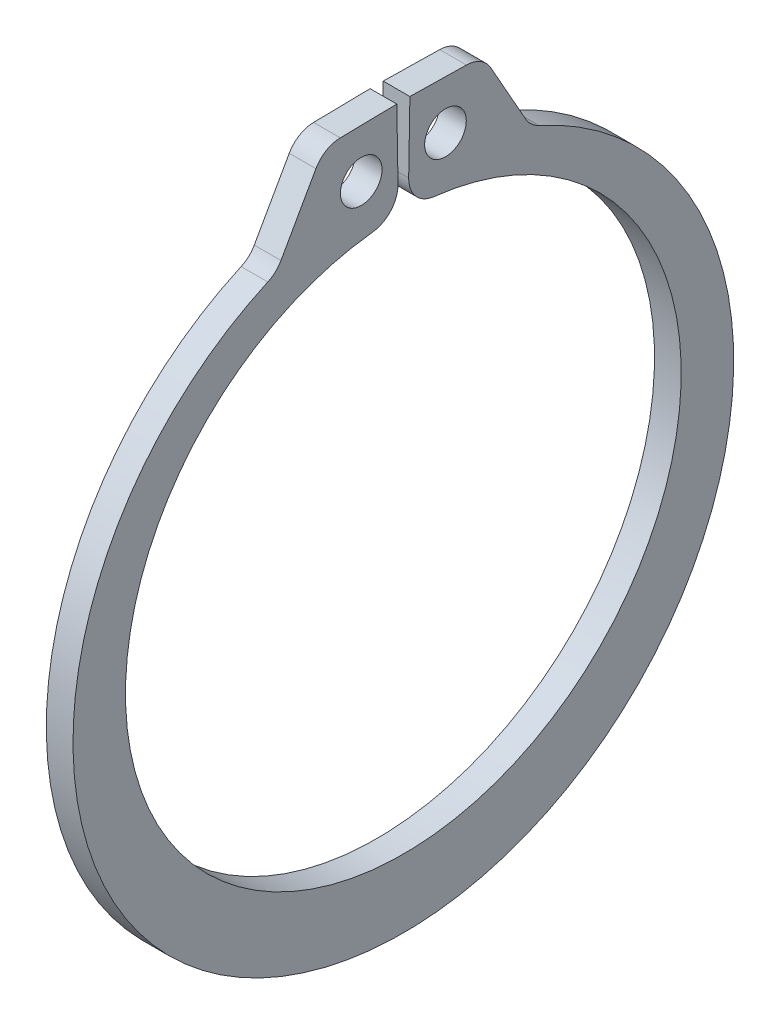
ISO-10303-21;
HEADER;
FILE_DESCRIPTION(('STEP AP214'),'2;1');
FILE_NAME('part.step','',(''),(''),'','','');
FILE_SCHEMA(('AUTOMOTIVE_DESIGN { 1 0 10303 214 1 1 1 1 }'));
ENDSEC;
DATA;
#1=APPLICATION_CONTEXT('core data for automotive mechanical design processes');
#2=APPLICATION_PROTOCOL_DEFINITION('international standard','automotive_design',2000,#1);
#3=PRODUCT_CONTEXT('',#1,'mechanical');
#4=PRODUCT('Part','Part','',(#3));
#5=PRODUCT_RELATED_PRODUCT_CATEGORY('part','',(#4));
#6=PRODUCT_DEFINITION_FORMATION('','',#4);
#7=PRODUCT_DEFINITION_CONTEXT('part definition',#1,'design');
#8=PRODUCT_DEFINITION('design','',#6,#7);
#9=PRODUCT_DEFINITION_SHAPE('','',#8);
#10=(LENGTH_UNIT() NAMED_UNIT(*) SI_UNIT(.MILLI.,.METRE.));
#11=(NAMED_UNIT(*) PLANE_ANGLE_UNIT() SI_UNIT($,.RADIAN.));
#12=(NAMED_UNIT(*) SI_UNIT($,.STERADIAN.) SOLID_ANGLE_UNIT());
#13=UNCERTAINTY_MEASURE_WITH_UNIT(LENGTH_MEASURE(1.E-05),#10,'distance_accuracy_value','');
#14=(GEOMETRIC_REPRESENTATION_CONTEXT(3) GLOBAL_UNCERTAINTY_ASSIGNED_CONTEXT((#13)) GLOBAL_UNIT_ASSIGNED_CONTEXT((#10,
#11,#12)) REPRESENTATION_CONTEXT('',''));
#15=CARTESIAN_POINT('',(0.,0.,0.));
#16=DIRECTION('',(0.,0.,1.));
#17=DIRECTION('',(1.,0.,0.));
#18=AXIS2_PLACEMENT_3D('',#15,#16,#17);
#19=CARTESIAN_POINT('',(0.635,-0.754341080067233,0.));
#20=DIRECTION('',(1.,0.,0.));
#21=DIRECTION('',(0.,0.,-1.));
#22=AXIS2_PLACEMENT_3D('',#19,#20,#21);
#23=PLANE('',#22);
#24=CARTESIAN_POINT('',(0.635,15.4994797667592,2.00435849396289));
#25=DIRECTION('',(1.,0.,0.));
#26=DIRECTION('',(0.,0.,-1.));
#27=AXIS2_PLACEMENT_3D('',#24,#25,#26);
#28=CIRCLE('',#27,0.990600000000001);
#29=CARTESIAN_POINT('',(0.635,15.4994797667592,1.01375849396289));
#30=VERTEX_POINT('',#29);
#31=EDGE_CURVE('E196',#30,#30,#28,.T.);
#32=ORIENTED_EDGE('',*,*,#31,.F.);
#33=EDGE_LOOP('',(#32));
#34=FACE_BOUND('',#33,.T.);
#35=DIRECTION('',(0.,0.87115587965409,0.491006551223208));
#36=VECTOR('',#35,1.);
#37=CARTESIAN_POINT('',(0.635,17.7802731101644,-3.77798395814039));
#38=LINE('',#37,#36);
#39=CARTESIAN_POINT('',(0.635,14.1508937957615,-5.82359836753103));
#40=VERTEX_POINT('',#39);
#41=CARTESIAN_POINT('',(0.635,17.1023893458657,-4.16005722081599));
#42=VERTEX_POINT('',#41);
#43=EDGE_CURVE('E204',#40,#42,#38,.T.);
#44=ORIENTED_EDGE('',*,*,#43,.T.);
#45=CARTESIAN_POINT('',(0.635,16.4351605434085,-2.97624349595404));
#46=DIRECTION('',(1.,0.,0.));
#47=DIRECTION('',(0.,0.,-1.));
#48=AXIS2_PLACEMENT_3D('',#45,#46,#47);
#49=CIRCLE('',#48,1.3589);
#50=CARTESIAN_POINT('',(0.635,17.7938535763566,-2.99995957106167));
#51=VERTEX_POINT('',#50);
#52=EDGE_CURVE('E263',#42,#51,#49,.T.);
#53=ORIENTED_EDGE('',*,*,#52,.T.);
#54=DIRECTION('',(0.,0.0174524064372832,0.999847695156391));
#55=VECTOR('',#54,1.);
#56=CARTESIAN_POINT('',(0.635,17.8407823485231,-0.311412014263668));
#57=LINE('',#56,#55);
#58=CARTESIAN_POINT('',(0.635,17.8407823485231,-0.311412014263668));
#59=VERTEX_POINT('',#58);
#60=EDGE_CURVE('E208',#51,#59,#57,.T.);
#61=ORIENTED_EDGE('',*,*,#60,.T.);
#62=DIRECTION('',(0.,-0.999847695156391,0.0174524064372838));
#63=VECTOR('',#62,1.);
#64=CARTESIAN_POINT('',(0.635,13.2186864233541,-0.230733029785392));
#65=LINE('',#64,#63);
#66=CARTESIAN_POINT('',(0.635,14.5139224558779,-0.253341458830463));
#67=VERTEX_POINT('',#66);
#68=EDGE_CURVE('E166',#59,#67,#65,.T.);
#69=ORIENTED_EDGE('',*,*,#68,.T.);
#70=CARTESIAN_POINT('',(0.635,14.4902063807703,-1.61203449177848));
#71=DIRECTION('',(1.,0.,0.));
#72=DIRECTION('',(0.,0.,-1.));
#73=AXIS2_PLACEMENT_3D('',#70,#71,#72);
#74=CIRCLE('',#73,1.3589);
#75=CARTESIAN_POINT('',(0.635,13.1396383644442,-1.46178389019286));
#76=VERTEX_POINT('',#75);
#77=EDGE_CURVE('E260',#67,#76,#74,.T.);
#78=ORIENTED_EDGE('',*,*,#77,.T.);
#79=CARTESIAN_POINT('',(0.635,0.,0.));
#80=DIRECTION('',(-1.,0.,0.));
#81=DIRECTION('',(0.,0.,-1.));
#82=AXIS2_PLACEMENT_3D('',#79,#80,#81);
#83=CIRCLE('',#82,13.2207);
#84=CARTESIAN_POINT('',(0.635,13.1396383644442,1.46178389019286));
#85=VERTEX_POINT('',#84);
#86=EDGE_CURVE('E213',#76,#85,#83,.T.);
#87=ORIENTED_EDGE('',*,*,#86,.T.);
#88=CARTESIAN_POINT('',(0.635,14.4902063807703,1.61203449177848));
#89=DIRECTION('',(1.,0.,0.));
#90=DIRECTION('',(0.,0.,-1.));
#91=AXIS2_PLACEMENT_3D('',#88,#89,#90);
#92=CIRCLE('',#91,1.3589);
#93=CARTESIAN_POINT('',(0.635,14.5139224558779,0.253341458830464));
#94=VERTEX_POINT('',#93);
#95=EDGE_CURVE('E257',#85,#94,#92,.T.);
#96=ORIENTED_EDGE('',*,*,#95,.T.);
#97=DIRECTION('',(0.,0.999847695156391,0.0174524064372836));
#98=VECTOR('',#97,1.);
#99=CARTESIAN_POINT('',(0.635,13.2186864233541,0.230733029785394));
#100=LINE('',#99,#98);
#101=CARTESIAN_POINT('',(0.635,17.8407823485231,0.311412014263668));
#102=VERTEX_POINT('',#101);
#103=EDGE_CURVE('E217',#94,#102,#100,.T.);
#104=ORIENTED_EDGE('',*,*,#103,.T.);
#105=DIRECTION('',(0.,-0.0174524064372832,0.999847695156391));
#106=VECTOR('',#105,1.);
#107=CARTESIAN_POINT('',(0.635,17.8407823485231,0.311412014263668));
#108=LINE('',#107,#106);
#109=CARTESIAN_POINT('',(0.635,17.7938535763566,2.99995957106167));
#110=VERTEX_POINT('',#109);
#111=EDGE_CURVE('E220',#102,#110,#108,.T.);
#112=ORIENTED_EDGE('',*,*,#111,.T.);
#113=CARTESIAN_POINT('',(0.635,16.4351605434085,2.97624349595404));
#114=DIRECTION('',(1.,0.,0.));
#115=DIRECTION('',(0.,0.,-1.));
#116=AXIS2_PLACEMENT_3D('',#113,#114,#115);
#117=CIRCLE('',#116,1.3589);
#118=CARTESIAN_POINT('',(0.635,17.1023893458657,4.16005722081599));
#119=VERTEX_POINT('',#118);
#120=EDGE_CURVE('E66',#110,#119,#117,.T.);
#121=ORIENTED_EDGE('',*,*,#120,.T.);
#122=DIRECTION('',(0.,-0.87115587965409,0.491006551223208));
#123=VECTOR('',#122,1.);
#124=CARTESIAN_POINT('',(0.635,17.7802731101644,3.77798395814039));
#125=LINE('',#124,#123);
#126=CARTESIAN_POINT('',(0.635,14.1508937957615,5.82359836753103));
#127=VERTEX_POINT('',#126);
#128=EDGE_CURVE('E223',#119,#127,#125,.T.);
#129=ORIENTED_EDGE('',*,*,#128,.T.);
#130=CARTESIAN_POINT('',(0.635,14.8181225982187,7.00741209239297));
#131=DIRECTION('',(1.,0.,0.));
#132=DIRECTION('',(0.,0.,-1.));
#133=AXIS2_PLACEMENT_3D('',#130,#131,#132);
#134=CIRCLE('',#133,1.3589);
#135=CARTESIAN_POINT('',(0.635,13.5789066113655,6.4497805402661));
#136=VERTEX_POINT('',#135);
#137=EDGE_CURVE('E11',#127,#136,#134,.F.);
#138=ORIENTED_EDGE('',*,*,#137,.T.);
#139=CARTESIAN_POINT('',(0.635,-0.754341080067233,0.));
#140=DIRECTION('',(1.,0.,0.));
#141=DIRECTION('',(0.,0.,-1.));
#142=AXIS2_PLACEMENT_3D('',#139,#140,#141);
#143=CIRCLE('',#142,15.7175589199328);
#144=CARTESIAN_POINT('',(0.635,13.5789066113655,-6.4497805402661));
#145=VERTEX_POINT('',#144);
#146=EDGE_CURVE('E200',#136,#145,#143,.T.);
#147=ORIENTED_EDGE('',*,*,#146,.T.);
#148=CARTESIAN_POINT('',(0.635,14.8181225982187,-7.00741209239297));
#149=DIRECTION('',(1.,0.,0.));
#150=DIRECTION('',(0.,0.,-1.));
#151=AXIS2_PLACEMENT_3D('',#148,#149,#150);
#152=CIRCLE('',#151,1.3589);
#153=EDGE_CURVE('E292',#145,#40,#152,.F.);
#154=ORIENTED_EDGE('',*,*,#153,.T.);
#155=EDGE_LOOP('',(#44,#53,#61,#69,#78,#87,#96,#104,#112,#121,#129,#138,#147,#154));
#156=FACE_BOUND('',#155,.T.);
#157=CARTESIAN_POINT('',(0.635,15.4994797667592,-2.00435849396289));
#158=DIRECTION('',(1.,0.,0.));
#159=DIRECTION('',(0.,0.,-1.));
#160=AXIS2_PLACEMENT_3D('',#157,#158,#159);
#161=CIRCLE('',#160,0.990600000000001);
#162=CARTESIAN_POINT('',(0.635,15.4994797667592,-2.99495849396289));
#163=VERTEX_POINT('',#162);
#164=EDGE_CURVE('E192',#163,#163,#161,.T.);
#165=ORIENTED_EDGE('',*,*,#164,.F.);
#166=EDGE_LOOP('',(#165));
#167=FACE_BOUND('',#166,.T.);
#168=ADVANCED_FACE('F43',(#34,#156,#167),#23,.T.);
#169=CARTESIAN_POINT('',(0.635,-0.754341080067233,0.));
#170=DIRECTION('',(-1.,0.,0.));
#171=DIRECTION('',(0.,0.,1.));
#172=AXIS2_PLACEMENT_3D('',#169,#170,#171);
#173=CYLINDRICAL_SURFACE('',#172,15.7175589199328);
#174=CARTESIAN_POINT('',(-0.635,-0.754341080067233,0.));
#175=DIRECTION('',(1.,0.,0.));
#176=DIRECTION('',(0.,0.,-1.));
#177=AXIS2_PLACEMENT_3D('',#174,#175,#176);
#178=CIRCLE('',#177,15.7175589199328);
#179=CARTESIAN_POINT('',(-0.635,13.5789066113655,6.4497805402661));
#180=VERTEX_POINT('',#179);
#181=CARTESIAN_POINT('',(-0.635,13.5789066113655,-6.4497805402661));
#182=VERTEX_POINT('',#181);
#183=EDGE_CURVE('E298',#180,#182,#178,.T.);
#184=ORIENTED_EDGE('',*,*,#183,.T.);
#185=DIRECTION('',(-1.,0.,0.));
#186=VECTOR('',#185,1.);
#187=CARTESIAN_POINT('',(0.635,13.5789066113655,-6.4497805402661));
#188=LINE('',#187,#186);
#189=EDGE_CURVE('E239',#182,#145,#188,.F.);
#190=ORIENTED_EDGE('',*,*,#189,.T.);
#191=ORIENTED_EDGE('',*,*,#146,.F.);
#192=DIRECTION('',(-1.,0.,0.));
#193=VECTOR('',#192,1.);
#194=CARTESIAN_POINT('',(0.635,13.5789066113655,6.44978054026611));
#195=LINE('',#194,#193);
#196=EDGE_CURVE('E235',#136,#180,#195,.T.);
#197=ORIENTED_EDGE('',*,*,#196,.T.);
#198=EDGE_LOOP('',(#184,#190,#191,#197));
#199=FACE_BOUND('',#198,.T.);
#200=ADVANCED_FACE('F308',(#199),#173,.T.);
#201=CARTESIAN_POINT('',(0.635,17.7802731101644,-3.77798395814039));
#202=DIRECTION('',(0.,-0.491006551223208,0.87115587965409));
#203=DIRECTION('',(0.,-0.87115587965409,-0.491006551223208));
#204=AXIS2_PLACEMENT_3D('',#201,#202,#203);
#205=PLANE('',#204);
#206=ORIENTED_EDGE('',*,*,#43,.F.);
#207=DIRECTION('',(1.,0.,0.));
#208=VECTOR('',#207,1.);
#209=CARTESIAN_POINT('',(-0.635,14.1508937957615,-5.82359836753103));
#210=LINE('',#209,#208);
#211=CARTESIAN_POINT('',(-0.635,14.1508937957615,-5.82359836753103));
#212=VERTEX_POINT('',#211);
#213=EDGE_CURVE('E231',#40,#212,#210,.F.);
#214=ORIENTED_EDGE('',*,*,#213,.T.);
#215=DIRECTION('',(0.,0.87115587965409,0.491006551223208));
#216=VECTOR('',#215,1.);
#217=CARTESIAN_POINT('',(-0.635,17.7802731101644,-3.77798395814039));
#218=LINE('',#217,#216);
#219=CARTESIAN_POINT('',(-0.635,17.1023893458657,-4.16005722081599));
#220=VERTEX_POINT('',#219);
#221=EDGE_CURVE('E159',#212,#220,#218,.T.);
#222=ORIENTED_EDGE('',*,*,#221,.T.);
#223=DIRECTION('',(-1.,0.,0.));
#224=VECTOR('',#223,1.);
#225=CARTESIAN_POINT('',(0.635,17.1023893458657,-4.16005722081599));
#226=LINE('',#225,#224);
#227=EDGE_CURVE('E168',#220,#42,#226,.F.);
#228=ORIENTED_EDGE('',*,*,#227,.T.);
#229=EDGE_LOOP('',(#206,#214,#222,#228));
#230=FACE_BOUND('',#229,.T.);
#231=ADVANCED_FACE('F316',(#230),#205,.F.);
#232=CARTESIAN_POINT('',(0.635,17.8407823485231,-0.311412014263668));
#233=DIRECTION('',(0.,-0.999847695156391,0.0174524064372832));
#234=DIRECTION('',(0.,-0.0174524064372832,-0.999847695156391));
#235=AXIS2_PLACEMENT_3D('',#232,#233,#234);
#236=PLANE('',#235);
#237=ORIENTED_EDGE('',*,*,#60,.F.);
#238=DIRECTION('',(-1.,0.,0.));
#239=VECTOR('',#238,1.);
#240=CARTESIAN_POINT('',(0.635,17.7938535763566,-2.99995957106167));
#241=LINE('',#240,#239);
#242=CARTESIAN_POINT('',(-0.635,17.7938535763566,-2.99995957106167));
#243=VERTEX_POINT('',#242);
#244=EDGE_CURVE('E154',#51,#243,#241,.T.);
#245=ORIENTED_EDGE('',*,*,#244,.T.);
#246=DIRECTION('',(0.,0.0174524064372832,0.999847695156391));
#247=VECTOR('',#246,1.);
#248=CARTESIAN_POINT('',(-0.635,17.8407823485231,-0.311412014263668));
#249=LINE('',#248,#247);
#250=CARTESIAN_POINT('',(-0.635,17.8407823485231,-0.311412014263668));
#251=VERTEX_POINT('',#250);
#252=EDGE_CURVE('E147',#243,#251,#249,.T.);
#253=ORIENTED_EDGE('',*,*,#252,.T.);
#254=DIRECTION('',(-1.,0.,0.));
#255=VECTOR('',#254,1.);
#256=CARTESIAN_POINT('',(0.635,17.8407823485231,-0.311412014263668));
#257=LINE('',#256,#255);
#258=EDGE_CURVE('E151',#59,#251,#257,.T.);
#259=ORIENTED_EDGE('',*,*,#258,.F.);
#260=EDGE_LOOP('',(#237,#245,#253,#259));
#261=FACE_BOUND('',#260,.T.);
#262=ADVANCED_FACE('F150',(#261),#236,.F.);
#263=CARTESIAN_POINT('',(0.635,13.2186864233541,-0.230733029785392));
#264=DIRECTION('',(0.,-0.0174524064372838,-0.999847695156391));
#265=DIRECTION('',(0.,0.999847695156391,-0.0174524064372838));
#266=AXIS2_PLACEMENT_3D('',#263,#264,#265);
#267=PLANE('',#266);
#268=DIRECTION('',(0.,-0.999847695156391,0.0174524064372838));
#269=VECTOR('',#268,1.);
#270=CARTESIAN_POINT('',(-0.635,13.2186864233541,-0.230733029785392));
#271=LINE('',#270,#269);
#272=CARTESIAN_POINT('',(-0.635,14.5139224558779,-0.253341458830463));
#273=VERTEX_POINT('',#272);
#274=EDGE_CURVE('E158',#251,#273,#271,.T.);
#275=ORIENTED_EDGE('',*,*,#274,.T.);
#276=DIRECTION('',(-1.,0.,0.));
#277=VECTOR('',#276,1.);
#278=CARTESIAN_POINT('',(0.635,14.5139224558779,-0.253341458830463));
#279=LINE('',#278,#277);
#280=EDGE_CURVE('E273',#273,#67,#279,.F.);
#281=ORIENTED_EDGE('',*,*,#280,.T.);
#282=ORIENTED_EDGE('',*,*,#68,.F.);
#283=ORIENTED_EDGE('',*,*,#258,.T.);
#284=EDGE_LOOP('',(#275,#281,#282,#283));
#285=FACE_BOUND('',#284,.T.);
#286=ADVANCED_FACE('F163',(#285),#267,.F.);
#287=CARTESIAN_POINT('',(0.635,0.,0.));
#288=DIRECTION('',(-1.,0.,0.));
#289=DIRECTION('',(0.,0.,1.));
#290=AXIS2_PLACEMENT_3D('',#287,#288,#289);
#291=CYLINDRICAL_SURFACE('',#290,13.2207);
#292=ORIENTED_EDGE('',*,*,#86,.F.);
#293=DIRECTION('',(-1.,0.,0.));
#294=VECTOR('',#293,1.);
#295=CARTESIAN_POINT('',(0.635,13.1396383644442,-1.46178389019286));
#296=LINE('',#295,#294);
#297=CARTESIAN_POINT('',(-0.635,13.1396383644442,-1.46178389019286));
#298=VERTEX_POINT('',#297);
#299=EDGE_CURVE('E269',#76,#298,#296,.T.);
#300=ORIENTED_EDGE('',*,*,#299,.T.);
#301=CARTESIAN_POINT('',(-0.635,0.,0.));
#302=DIRECTION('',(-1.,0.,0.));
#303=DIRECTION('',(0.,0.,-1.));
#304=AXIS2_PLACEMENT_3D('',#301,#302,#303);
#305=CIRCLE('',#304,13.2207);
#306=CARTESIAN_POINT('',(-0.635,13.1396383644442,1.46178389019286));
#307=VERTEX_POINT('',#306);
#308=EDGE_CURVE('E175',#298,#307,#305,.T.);
#309=ORIENTED_EDGE('',*,*,#308,.T.);
#310=DIRECTION('',(-1.,0.,0.));
#311=VECTOR('',#310,1.);
#312=CARTESIAN_POINT('',(0.635,13.1396383644442,1.46178389019286));
#313=LINE('',#312,#311);
#314=EDGE_CURVE('E266',#307,#85,#313,.F.);
#315=ORIENTED_EDGE('',*,*,#314,.T.);
#316=EDGE_LOOP('',(#292,#300,#309,#315));
#317=FACE_BOUND('',#316,.T.);
#318=ADVANCED_FACE('F328',(#317),#291,.F.);
#319=CARTESIAN_POINT('',(0.635,13.2186864233541,0.230733029785394));
#320=DIRECTION('',(0.,-0.0174524064372836,0.999847695156391));
#321=DIRECTION('',(0.,-0.999847695156391,-0.0174524064372836));
#322=AXIS2_PLACEMENT_3D('',#319,#320,#321);
#323=PLANE('',#322);
#324=ORIENTED_EDGE('',*,*,#103,.F.);
#325=DIRECTION('',(-1.,0.,0.));
#326=VECTOR('',#325,1.);
#327=CARTESIAN_POINT('',(0.635,14.5139224558779,0.253341458830464));
#328=LINE('',#327,#326);
#329=CARTESIAN_POINT('',(-0.635,14.5139224558779,0.253341458830464));
#330=VERTEX_POINT('',#329);
#331=EDGE_CURVE('E276',#94,#330,#328,.T.);
#332=ORIENTED_EDGE('',*,*,#331,.T.);
#333=DIRECTION('',(0.,0.999847695156391,0.0174524064372836));
#334=VECTOR('',#333,1.);
#335=CARTESIAN_POINT('',(-0.635,13.2186864233541,0.230733029785394));
#336=LINE('',#335,#334);
#337=CARTESIAN_POINT('',(-0.635,17.8407823485231,0.311412014263668));
#338=VERTEX_POINT('',#337);
#339=EDGE_CURVE('E179',#330,#338,#336,.T.);
#340=ORIENTED_EDGE('',*,*,#339,.T.);
#341=DIRECTION('',(-1.,0.,0.));
#342=VECTOR('',#341,1.);
#343=CARTESIAN_POINT('',(0.635,17.8407823485231,0.311412014263668));
#344=LINE('',#343,#342);
#345=EDGE_CURVE('E169',#102,#338,#344,.T.);
#346=ORIENTED_EDGE('',*,*,#345,.F.);
#347=EDGE_LOOP('',(#324,#332,#340,#346));
#348=FACE_BOUND('',#347,.T.);
#349=ADVANCED_FACE('F338',(#348),#323,.F.);
#350=CARTESIAN_POINT('',(0.635,17.8407823485231,0.311412014263668));
#351=DIRECTION('',(0.,-0.999847695156391,-0.0174524064372832));
#352=DIRECTION('',(0.,0.0174524064372832,-0.999847695156391));
#353=AXIS2_PLACEMENT_3D('',#350,#351,#352);
#354=PLANE('',#353);
#355=DIRECTION('',(0.,-0.0174524064372832,0.999847695156391));
#356=VECTOR('',#355,1.);
#357=CARTESIAN_POINT('',(-0.635,17.8407823485231,0.311412014263668));
#358=LINE('',#357,#356);
#359=CARTESIAN_POINT('',(-0.635,17.7938535763566,2.99995957106167));
#360=VERTEX_POINT('',#359);
#361=EDGE_CURVE('E185',#338,#360,#358,.T.);
#362=ORIENTED_EDGE('',*,*,#361,.T.);
#363=DIRECTION('',(-1.,0.,0.));
#364=VECTOR('',#363,1.);
#365=CARTESIAN_POINT('',(0.635,17.7938535763566,2.99995957106167));
#366=LINE('',#365,#364);
#367=EDGE_CURVE('E286',#360,#110,#366,.F.);
#368=ORIENTED_EDGE('',*,*,#367,.T.);
#369=ORIENTED_EDGE('',*,*,#111,.F.);
#370=ORIENTED_EDGE('',*,*,#345,.T.);
#371=EDGE_LOOP('',(#362,#368,#369,#370));
#372=FACE_BOUND('',#371,.T.);
#373=ADVANCED_FACE('F345',(#372),#354,.F.);
#374=CARTESIAN_POINT('',(0.635,17.7802731101644,3.77798395814039));
#375=DIRECTION('',(0.,-0.491006551223208,-0.87115587965409));
#376=DIRECTION('',(0.,0.87115587965409,-0.491006551223208));
#377=AXIS2_PLACEMENT_3D('',#374,#375,#376);
#378=PLANE('',#377);
#379=ORIENTED_EDGE('',*,*,#128,.F.);
#380=DIRECTION('',(-1.,0.,0.));
#381=VECTOR('',#380,1.);
#382=CARTESIAN_POINT('',(0.635,17.1023893458657,4.16005722081599));
#383=LINE('',#382,#381);
#384=CARTESIAN_POINT('',(-0.635,17.1023893458657,4.16005722081599));
#385=VERTEX_POINT('',#384);
#386=EDGE_CURVE('E282',#119,#385,#383,.T.);
#387=ORIENTED_EDGE('',*,*,#386,.T.);
#388=DIRECTION('',(0.,-0.87115587965409,0.491006551223208));
#389=VECTOR('',#388,1.);
#390=CARTESIAN_POINT('',(-0.635,17.7802731101644,3.77798395814039));
#391=LINE('',#390,#389);
#392=CARTESIAN_POINT('',(-0.635,14.1508937957615,5.82359836753103));
#393=VERTEX_POINT('',#392);
#394=EDGE_CURVE('E189',#385,#393,#391,.T.);
#395=ORIENTED_EDGE('',*,*,#394,.T.);
#396=DIRECTION('',(1.,0.,0.));
#397=VECTOR('',#396,1.);
#398=CARTESIAN_POINT('',(0.635,14.1508937957615,5.82359836753103));
#399=LINE('',#398,#397);
#400=EDGE_CURVE('E59',#393,#127,#399,.T.);
#401=ORIENTED_EDGE('',*,*,#400,.T.);
#402=EDGE_LOOP('',(#379,#387,#395,#401));
#403=FACE_BOUND('',#402,.T.);
#404=ADVANCED_FACE('F301',(#403),#378,.F.);
#405=CARTESIAN_POINT('',(0.635,15.4994797667592,2.00435849396289));
#406=DIRECTION('',(-1.,0.,0.));
#407=DIRECTION('',(0.,0.,1.));
#408=AXIS2_PLACEMENT_3D('',#405,#406,#407);
#409=CYLINDRICAL_SURFACE('',#408,0.990600000000001);
#410=ORIENTED_EDGE('',*,*,#31,.T.);
#411=EDGE_LOOP('',(#410));
#412=FACE_BOUND('',#411,.T.);
#413=CARTESIAN_POINT('',(-0.635,15.4994797667592,2.00435849396289));
#414=DIRECTION('',(1.,0.,0.));
#415=DIRECTION('',(0.,0.,-1.));
#416=AXIS2_PLACEMENT_3D('',#413,#414,#415);
#417=CIRCLE('',#416,0.990600000000001);
#418=CARTESIAN_POINT('',(-0.635,15.4994797667592,1.01375849396289));
#419=VERTEX_POINT('',#418);
#420=EDGE_CURVE('E383',#419,#419,#417,.T.);
#421=ORIENTED_EDGE('',*,*,#420,.F.);
#422=EDGE_LOOP('',(#421));
#423=FACE_BOUND('',#422,.T.);
#424=ADVANCED_FACE('F352',(#412,#423),#409,.F.);
#425=CARTESIAN_POINT('',(0.635,15.4994797667592,-2.00435849396289));
#426=DIRECTION('',(-1.,0.,0.));
#427=DIRECTION('',(0.,0.,1.));
#428=AXIS2_PLACEMENT_3D('',#425,#426,#427);
#429=CYLINDRICAL_SURFACE('',#428,0.990600000000001);
#430=ORIENTED_EDGE('',*,*,#164,.T.);
#431=EDGE_LOOP('',(#430));
#432=FACE_BOUND('',#431,.T.);
#433=CARTESIAN_POINT('',(-0.635,15.4994797667592,-2.00435849396289));
#434=DIRECTION('',(1.,0.,0.));
#435=DIRECTION('',(0.,0.,-1.));
#436=AXIS2_PLACEMENT_3D('',#433,#434,#435);
#437=CIRCLE('',#436,0.990600000000001);
#438=CARTESIAN_POINT('',(-0.635,15.4994797667592,-2.99495849396289));
#439=VERTEX_POINT('',#438);
#440=EDGE_CURVE('E380',#439,#439,#437,.T.);
#441=ORIENTED_EDGE('',*,*,#440,.F.);
#442=EDGE_LOOP('',(#441));
#443=FACE_BOUND('',#442,.T.);
#444=ADVANCED_FACE('F367',(#432,#443),#429,.F.);
#445=CARTESIAN_POINT('',(-0.635,-0.754341080067233,0.));
#446=DIRECTION('',(1.,0.,0.));
#447=DIRECTION('',(0.,0.,-1.));
#448=AXIS2_PLACEMENT_3D('',#445,#446,#447);
#449=PLANE('',#448);
#450=ORIENTED_EDGE('',*,*,#440,.T.);
#451=EDGE_LOOP('',(#450));
#452=FACE_BOUND('',#451,.T.);
#453=ORIENTED_EDGE('',*,*,#420,.T.);
#454=EDGE_LOOP('',(#453));
#455=FACE_BOUND('',#454,.T.);
#456=ORIENTED_EDGE('',*,*,#252,.F.);
#457=CARTESIAN_POINT('',(-0.635,16.4351605434085,-2.97624349595404));
#458=DIRECTION('',(1.,0.,0.));
#459=DIRECTION('',(0.,0.,-1.));
#460=AXIS2_PLACEMENT_3D('',#457,#458,#459);
#461=CIRCLE('',#460,1.3589);
#462=EDGE_CURVE('E252',#243,#220,#461,.F.);
#463=ORIENTED_EDGE('',*,*,#462,.T.);
#464=ORIENTED_EDGE('',*,*,#221,.F.);
#465=CARTESIAN_POINT('',(-0.635,14.8181225982187,-7.00741209239297));
#466=DIRECTION('',(1.,0.,0.));
#467=DIRECTION('',(0.,0.,-1.));
#468=AXIS2_PLACEMENT_3D('',#465,#466,#467);
#469=CIRCLE('',#468,1.3589);
#470=EDGE_CURVE('E289',#212,#182,#469,.T.);
#471=ORIENTED_EDGE('',*,*,#470,.T.);
#472=ORIENTED_EDGE('',*,*,#183,.F.);
#473=CARTESIAN_POINT('',(-0.635,14.8181225982187,7.00741209239297));
#474=DIRECTION('',(1.,0.,0.));
#475=DIRECTION('',(0.,0.,-1.));
#476=AXIS2_PLACEMENT_3D('',#473,#474,#475);
#477=CIRCLE('',#476,1.3589);
#478=EDGE_CURVE('E52',#180,#393,#477,.T.);
#479=ORIENTED_EDGE('',*,*,#478,.T.);
#480=ORIENTED_EDGE('',*,*,#394,.F.);
#481=CARTESIAN_POINT('',(-0.635,16.4351605434085,2.97624349595404));
#482=DIRECTION('',(1.,0.,0.));
#483=DIRECTION('',(0.,0.,-1.));
#484=AXIS2_PLACEMENT_3D('',#481,#482,#483);
#485=CIRCLE('',#484,1.3589);
#486=EDGE_CURVE('E244',#385,#360,#485,.F.);
#487=ORIENTED_EDGE('',*,*,#486,.T.);
#488=ORIENTED_EDGE('',*,*,#361,.F.);
#489=ORIENTED_EDGE('',*,*,#339,.F.);
#490=CARTESIAN_POINT('',(-0.635,14.4902063807703,1.61203449177848));
#491=DIRECTION('',(1.,0.,0.));
#492=DIRECTION('',(0.,0.,-1.));
#493=AXIS2_PLACEMENT_3D('',#490,#491,#492);
#494=CIRCLE('',#493,1.3589);
#495=EDGE_CURVE('E247',#330,#307,#494,.F.);
#496=ORIENTED_EDGE('',*,*,#495,.T.);
#497=ORIENTED_EDGE('',*,*,#308,.F.);
#498=CARTESIAN_POINT('',(-0.635,14.4902063807703,-1.61203449177848));
#499=DIRECTION('',(1.,0.,0.));
#500=DIRECTION('',(0.,0.,-1.));
#501=AXIS2_PLACEMENT_3D('',#498,#499,#500);
#502=CIRCLE('',#501,1.3589);
#503=EDGE_CURVE('E173',#298,#273,#502,.F.);
#504=ORIENTED_EDGE('',*,*,#503,.T.);
#505=ORIENTED_EDGE('',*,*,#274,.F.);
#506=EDGE_LOOP('',(#456,#463,#464,#471,#472,#479,#480,#487,#488,#489,#496,#497,#504,#505));
#507=FACE_BOUND('',#506,.T.);
#508=ADVANCED_FACE('F171',(#452,#455,#507),#449,.F.);
#509=CARTESIAN_POINT('',(0.635,14.8181225982187,-7.00741209239297));
#510=DIRECTION('',(-1.,0.,0.));
#511=DIRECTION('',(0.,0.,1.));
#512=AXIS2_PLACEMENT_3D('',#509,#510,#511);
#513=CYLINDRICAL_SURFACE('',#512,1.3589);
#514=ORIENTED_EDGE('',*,*,#153,.F.);
#515=ORIENTED_EDGE('',*,*,#189,.F.);
#516=ORIENTED_EDGE('',*,*,#470,.F.);
#517=ORIENTED_EDGE('',*,*,#213,.F.);
#518=EDGE_LOOP('',(#514,#515,#516,#517));
#519=FACE_BOUND('',#518,.T.);
#520=ADVANCED_FACE('F311',(#519),#513,.F.);
#521=CARTESIAN_POINT('',(0.635,16.4351605434085,-2.97624349595404));
#522=DIRECTION('',(-1.,0.,0.));
#523=DIRECTION('',(0.,0.,1.));
#524=AXIS2_PLACEMENT_3D('',#521,#522,#523);
#525=CYLINDRICAL_SURFACE('',#524,1.3589);
#526=ORIENTED_EDGE('',*,*,#52,.F.);
#527=ORIENTED_EDGE('',*,*,#227,.F.);
#528=ORIENTED_EDGE('',*,*,#462,.F.);
#529=ORIENTED_EDGE('',*,*,#244,.F.);
#530=EDGE_LOOP('',(#526,#527,#528,#529));
#531=FACE_BOUND('',#530,.T.);
#532=ADVANCED_FACE('F321',(#531),#525,.T.);
#533=CARTESIAN_POINT('',(0.635,14.4902063807703,-1.61203449177848));
#534=DIRECTION('',(-1.,0.,0.));
#535=DIRECTION('',(0.,0.,1.));
#536=AXIS2_PLACEMENT_3D('',#533,#534,#535);
#537=CYLINDRICAL_SURFACE('',#536,1.3589);
#538=ORIENTED_EDGE('',*,*,#77,.F.);
#539=ORIENTED_EDGE('',*,*,#280,.F.);
#540=ORIENTED_EDGE('',*,*,#503,.F.);
#541=ORIENTED_EDGE('',*,*,#299,.F.);
#542=EDGE_LOOP('',(#538,#539,#540,#541));
#543=FACE_BOUND('',#542,.T.);
#544=ADVANCED_FACE('F326',(#543),#537,.T.);
#545=CARTESIAN_POINT('',(0.635,14.4902063807703,1.61203449177848));
#546=DIRECTION('',(-1.,0.,0.));
#547=DIRECTION('',(0.,0.,1.));
#548=AXIS2_PLACEMENT_3D('',#545,#546,#547);
#549=CYLINDRICAL_SURFACE('',#548,1.3589);
#550=ORIENTED_EDGE('',*,*,#95,.F.);
#551=ORIENTED_EDGE('',*,*,#314,.F.);
#552=ORIENTED_EDGE('',*,*,#495,.F.);
#553=ORIENTED_EDGE('',*,*,#331,.F.);
#554=EDGE_LOOP('',(#550,#551,#552,#553));
#555=FACE_BOUND('',#554,.T.);
#556=ADVANCED_FACE('F335',(#555),#549,.T.);
#557=CARTESIAN_POINT('',(0.635,16.4351605434085,2.97624349595404));
#558=DIRECTION('',(-1.,0.,0.));
#559=DIRECTION('',(0.,0.,1.));
#560=AXIS2_PLACEMENT_3D('',#557,#558,#559);
#561=CYLINDRICAL_SURFACE('',#560,1.3589);
#562=ORIENTED_EDGE('',*,*,#120,.F.);
#563=ORIENTED_EDGE('',*,*,#367,.F.);
#564=ORIENTED_EDGE('',*,*,#486,.F.);
#565=ORIENTED_EDGE('',*,*,#386,.F.);
#566=EDGE_LOOP('',(#562,#563,#564,#565));
#567=FACE_BOUND('',#566,.T.);
#568=ADVANCED_FACE('F344',(#567),#561,.T.);
#569=CARTESIAN_POINT('',(0.635,14.8181225982187,7.00741209239297));
#570=DIRECTION('',(-1.,0.,0.));
#571=DIRECTION('',(0.,0.,1.));
#572=AXIS2_PLACEMENT_3D('',#569,#570,#571);
#573=CYLINDRICAL_SURFACE('',#572,1.3589);
#574=ORIENTED_EDGE('',*,*,#137,.F.);
#575=ORIENTED_EDGE('',*,*,#400,.F.);
#576=ORIENTED_EDGE('',*,*,#478,.F.);
#577=ORIENTED_EDGE('',*,*,#196,.F.);
#578=EDGE_LOOP('',(#574,#575,#576,#577));
#579=FACE_BOUND('',#578,.T.);
#580=ADVANCED_FACE('F45',(#579),#573,.F.);
#581=CLOSED_SHELL('',(#168,#200,#231,#262,#286,#318,#349,#373,#404,#424,#444,#508,#520,#532,
#544,#556,#568,#580));
#582=MANIFOLD_SOLID_BREP('B2',#581);
#583=ADVANCED_BREP_SHAPE_REPRESENTATION('',(#18,#582),#14);
#584=SHAPE_DEFINITION_REPRESENTATION(#9,#583);
ENDSEC;
END-ISO-10303-21;
